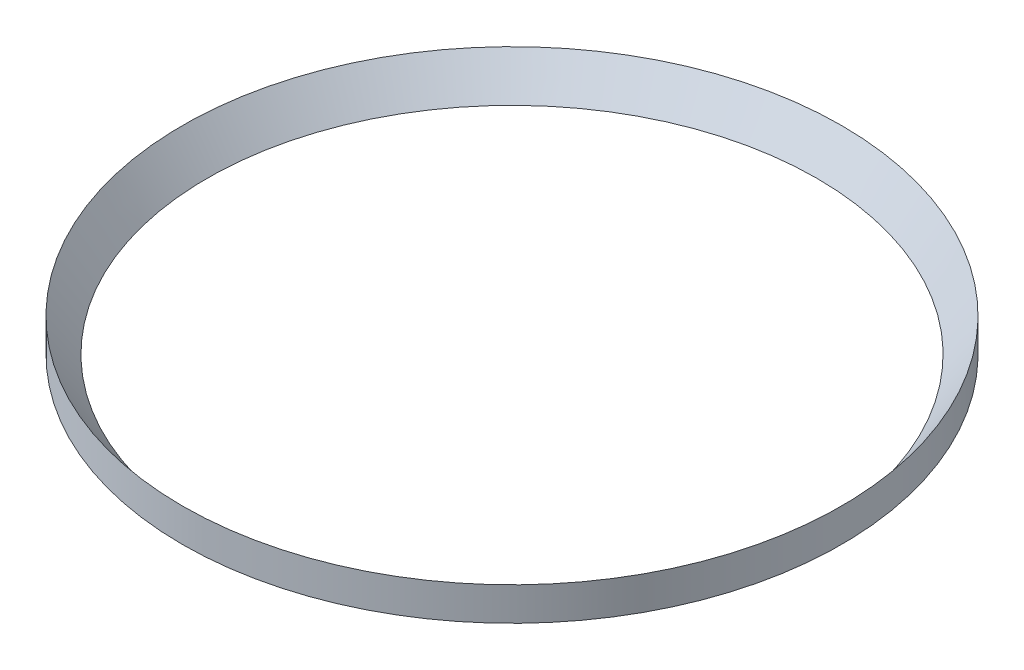
ISO-10303-21;
HEADER;
FILE_DESCRIPTION(('STEP AP214'),'2;1');
FILE_NAME('part.step','',(''),(''),'','','');
FILE_SCHEMA(('AUTOMOTIVE_DESIGN { 1 0 10303 214 1 1 1 1 }'));
ENDSEC;
DATA;
#1=APPLICATION_CONTEXT('core data for automotive mechanical design processes');
#2=APPLICATION_PROTOCOL_DEFINITION('international standard','automotive_design',2000,#1);
#3=PRODUCT_CONTEXT('',#1,'mechanical');
#4=PRODUCT('Part','Part','',(#3));
#5=PRODUCT_RELATED_PRODUCT_CATEGORY('part','',(#4));
#6=PRODUCT_DEFINITION_FORMATION('','',#4);
#7=PRODUCT_DEFINITION_CONTEXT('part definition',#1,'design');
#8=PRODUCT_DEFINITION('design','',#6,#7);
#9=PRODUCT_DEFINITION_SHAPE('','',#8);
#10=(LENGTH_UNIT() NAMED_UNIT(*) SI_UNIT(.MILLI.,.METRE.));
#11=(NAMED_UNIT(*) PLANE_ANGLE_UNIT() SI_UNIT($,.RADIAN.));
#12=(NAMED_UNIT(*) SI_UNIT($,.STERADIAN.) SOLID_ANGLE_UNIT());
#13=UNCERTAINTY_MEASURE_WITH_UNIT(LENGTH_MEASURE(1.E-05),#10,'distance_accuracy_value','');
#14=(GEOMETRIC_REPRESENTATION_CONTEXT(3) GLOBAL_UNCERTAINTY_ASSIGNED_CONTEXT((#13)) GLOBAL_UNIT_ASSIGNED_CONTEXT((#10,
#11,#12)) REPRESENTATION_CONTEXT('',''));
#15=CARTESIAN_POINT('',(0.,0.,0.));
#16=DIRECTION('',(0.,0.,1.));
#17=DIRECTION('',(1.,0.,0.));
#18=AXIS2_PLACEMENT_3D('',#15,#16,#17);
#19=CARTESIAN_POINT('',(-14.8,0.,0.));
#20=DIRECTION('',(0.,1.,0.));
#21=DIRECTION('',(0.,0.,1.));
#22=AXIS2_PLACEMENT_3D('',#19,#20,#21);
#23=PLANE('',#22);
#24=CARTESIAN_POINT('',(0.,0.,0.));
#25=DIRECTION('',(0.,-1.,0.));
#26=DIRECTION('',(0.,0.,-1.));
#27=AXIS2_PLACEMENT_3D('',#24,#25,#26);
#28=CIRCLE('',#27,14.8);
#29=CARTESIAN_POINT('',(0.,0.,-14.8));
#30=VERTEX_POINT('',#29);
#31=EDGE_CURVE('E40',#30,#30,#28,.T.);
#32=ORIENTED_EDGE('',*,*,#31,.F.);
#33=EDGE_LOOP('',(#32));
#34=FACE_BOUND('',#33,.T.);
#35=CARTESIAN_POINT('',(0.,0.,0.));
#36=DIRECTION('',(0.,-1.,0.));
#37=DIRECTION('',(0.,0.,-1.));
#38=AXIS2_PLACEMENT_3D('',#35,#36,#37);
#39=CIRCLE('',#38,16.);
#40=CARTESIAN_POINT('',(0.,0.,-16.));
#41=VERTEX_POINT('',#40);
#42=EDGE_CURVE('E10',#41,#41,#39,.T.);
#43=ORIENTED_EDGE('',*,*,#42,.T.);
#44=EDGE_LOOP('',(#43));
#45=FACE_BOUND('',#44,.T.);
#46=ADVANCED_FACE('F30',(#34,#45),#23,.F.);
#47=CARTESIAN_POINT('',(0.,0.,0.));
#48=DIRECTION('',(0.,-1.,0.));
#49=DIRECTION('',(0.,0.,-1.));
#50=AXIS2_PLACEMENT_3D('',#47,#48,#49);
#51=CYLINDRICAL_SURFACE('',#50,16.);
#52=ORIENTED_EDGE('',*,*,#42,.F.);
#53=EDGE_LOOP('',(#52));
#54=FACE_BOUND('',#53,.T.);
#55=CARTESIAN_POINT('',(0.,1.62,0.));
#56=DIRECTION('',(0.,-1.,0.));
#57=DIRECTION('',(0.,0.,-1.));
#58=AXIS2_PLACEMENT_3D('',#55,#56,#57);
#59=CIRCLE('',#58,16.);
#60=CARTESIAN_POINT('',(0.,1.62,-16.));
#61=VERTEX_POINT('',#60);
#62=EDGE_CURVE('E36',#61,#61,#59,.T.);
#63=ORIENTED_EDGE('',*,*,#62,.T.);
#64=EDGE_LOOP('',(#63));
#65=FACE_BOUND('',#64,.T.);
#66=ADVANCED_FACE('F50',(#54,#65),#51,.T.);
#67=CARTESIAN_POINT('',(0.,0.,0.));
#68=DIRECTION('',(0.,1.,0.));
#69=DIRECTION('',(0.,0.,1.));
#70=AXIS2_PLACEMENT_3D('',#67,#68,#69);
#71=CONICAL_SURFACE('',#70,14.8,0.637548798138693);
#72=ORIENTED_EDGE('',*,*,#62,.F.);
#73=EDGE_LOOP('',(#72));
#74=FACE_BOUND('',#73,.T.);
#75=ORIENTED_EDGE('',*,*,#31,.T.);
#76=EDGE_LOOP('',(#75));
#77=FACE_BOUND('',#76,.T.);
#78=ADVANCED_FACE('F47',(#74,#77),#71,.F.);
#79=CLOSED_SHELL('',(#46,#66,#78));
#80=MANIFOLD_SOLID_BREP('B2',#79);
#81=ADVANCED_BREP_SHAPE_REPRESENTATION('',(#18,#80),#14);
#82=SHAPE_DEFINITION_REPRESENTATION(#9,#81);
ENDSEC;
END-ISO-10303-21;
